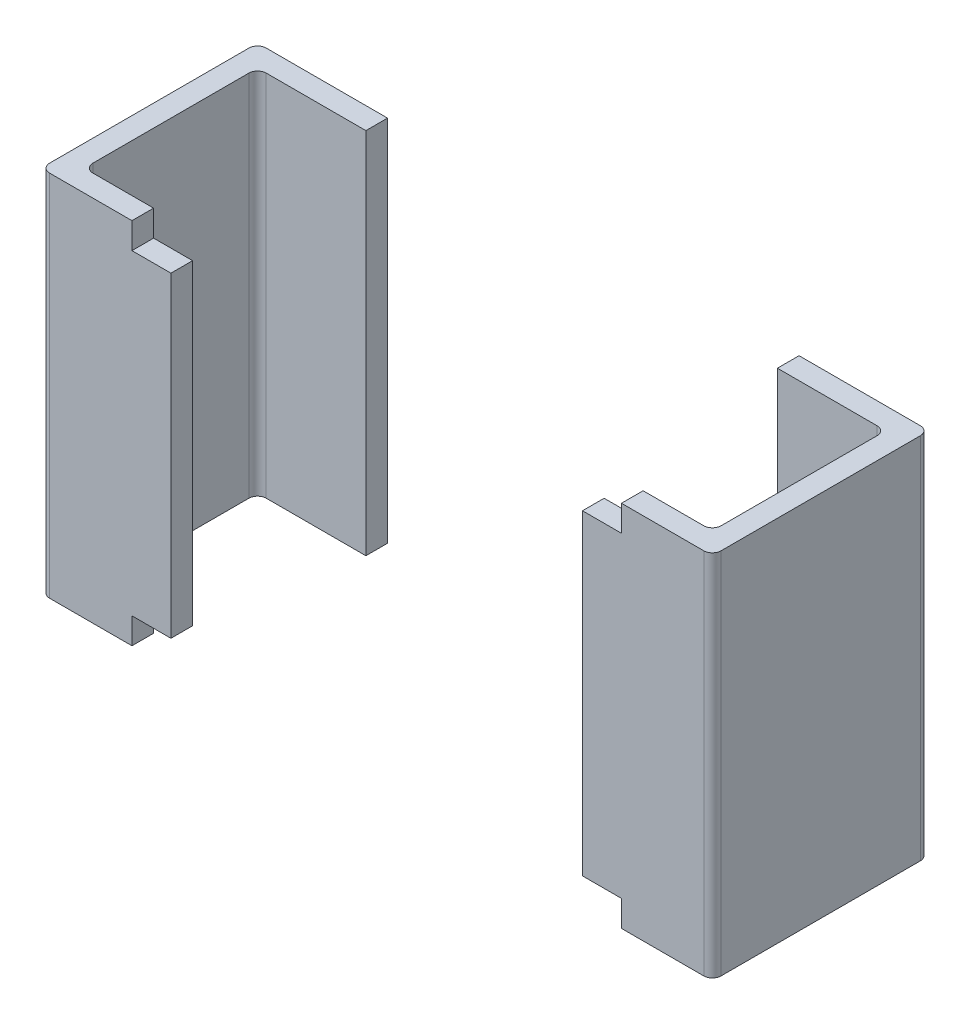
ISO-10303-21;
HEADER;
FILE_DESCRIPTION(('STEP AP214'),'2;1');
FILE_NAME('part.step','',(''),(''),'','','');
FILE_SCHEMA(('AUTOMOTIVE_DESIGN { 1 0 10303 214 1 1 1 1 }'));
ENDSEC;
DATA;
#1=APPLICATION_CONTEXT('core data for automotive mechanical design processes');
#2=APPLICATION_PROTOCOL_DEFINITION('international standard','automotive_design',2000,#1);
#3=PRODUCT_CONTEXT('',#1,'mechanical');
#4=PRODUCT('Part','Part','',(#3));
#5=PRODUCT_RELATED_PRODUCT_CATEGORY('part','',(#4));
#6=PRODUCT_DEFINITION_FORMATION('','',#4);
#7=PRODUCT_DEFINITION_CONTEXT('part definition',#1,'design');
#8=PRODUCT_DEFINITION('design','',#6,#7);
#9=PRODUCT_DEFINITION_SHAPE('','',#8);
#10=(LENGTH_UNIT() NAMED_UNIT(*) SI_UNIT(.MILLI.,.METRE.));
#11=(NAMED_UNIT(*) PLANE_ANGLE_UNIT() SI_UNIT($,.RADIAN.));
#12=(NAMED_UNIT(*) SI_UNIT($,.STERADIAN.) SOLID_ANGLE_UNIT());
#13=UNCERTAINTY_MEASURE_WITH_UNIT(LENGTH_MEASURE(1.E-05),#10,'distance_accuracy_value','');
#14=(GEOMETRIC_REPRESENTATION_CONTEXT(3) GLOBAL_UNCERTAINTY_ASSIGNED_CONTEXT((#13)) GLOBAL_UNIT_ASSIGNED_CONTEXT((#10,
#11,#12)) REPRESENTATION_CONTEXT('',''));
#15=CARTESIAN_POINT('',(0.,0.,0.));
#16=DIRECTION('',(0.,0.,1.));
#17=DIRECTION('',(1.,0.,0.));
#18=AXIS2_PLACEMENT_3D('',#15,#16,#17);
#19=CARTESIAN_POINT('',(-0.705,0.425,0.43));
#20=DIRECTION('',(0.,1.,0.));
#21=DIRECTION('',(-0.707106781186548,0.,0.707106781186548));
#22=AXIS2_PLACEMENT_3D('',#19,#20,#21);
#23=CYLINDRICAL_SURFACE('',#22,0.02);
#24=CARTESIAN_POINT('',(-0.705,-0.425,0.43));
#25=DIRECTION('',(0.,-1.,0.));
#26=DIRECTION('',(-0.707106781186548,0.,0.707106781186548));
#27=AXIS2_PLACEMENT_3D('',#24,#25,#26);
#28=CIRCLE('',#27,0.02);
#29=CARTESIAN_POINT('',(-0.705,-0.425,0.45));
#30=VERTEX_POINT('',#29);
#31=CARTESIAN_POINT('',(-0.725,-0.425,0.43));
#32=VERTEX_POINT('',#31);
#33=EDGE_CURVE('P0_E11',#30,#32,#28,.T.);
#34=ORIENTED_EDGE('',*,*,#33,.T.);
#35=DIRECTION('',(0.,1.,0.));
#36=VECTOR('',#35,1.);
#37=CARTESIAN_POINT('',(-0.725,0.425,0.43));
#38=LINE('',#37,#36);
#39=CARTESIAN_POINT('',(-0.725,0.425,0.43));
#40=VERTEX_POINT('',#39);
#41=EDGE_CURVE('P0_E28',#32,#40,#38,.T.);
#42=ORIENTED_EDGE('',*,*,#41,.T.);
#43=CARTESIAN_POINT('',(-0.705,0.425,0.43));
#44=DIRECTION('',(0.,1.,0.));
#45=DIRECTION('',(-0.707106781186548,0.,0.707106781186548));
#46=AXIS2_PLACEMENT_3D('',#43,#44,#45);
#47=CIRCLE('',#46,0.02);
#48=CARTESIAN_POINT('',(-0.705,0.425,0.45));
#49=VERTEX_POINT('',#48);
#50=EDGE_CURVE('P0_E258',#40,#49,#47,.T.);
#51=ORIENTED_EDGE('',*,*,#50,.T.);
#52=DIRECTION('',(0.,-1.,0.));
#53=VECTOR('',#52,1.);
#54=CARTESIAN_POINT('',(-0.705,0.425,0.45));
#55=LINE('',#54,#53);
#56=EDGE_CURVE('P0_E265',#49,#30,#55,.T.);
#57=ORIENTED_EDGE('',*,*,#56,.T.);
#58=EDGE_LOOP('',(#34,#42,#51,#57));
#59=FACE_BOUND('',#58,.T.);
#60=ADVANCED_FACE('P0_F17',(#59),#23,.F.);
#61=CARTESIAN_POINT('',(-0.725,0.425,0.05));
#62=DIRECTION('',(-1.,0.,0.));
#63=DIRECTION('',(0.,1.,0.));
#64=AXIS2_PLACEMENT_3D('',#61,#62,#63);
#65=PLANE('',#64);
#66=ORIENTED_EDGE('',*,*,#41,.F.);
#67=DIRECTION('',(0.,0.,1.));
#68=VECTOR('',#67,1.);
#69=CARTESIAN_POINT('',(-0.725,-0.425,0.025));
#70=LINE('',#69,#68);
#71=CARTESIAN_POINT('',(-0.725,-0.425,0.07));
#72=VERTEX_POINT('',#71);
#73=EDGE_CURVE('P0_E234',#72,#32,#70,.T.);
#74=ORIENTED_EDGE('',*,*,#73,.F.);
#75=DIRECTION('',(0.,-1.,0.));
#76=VECTOR('',#75,1.);
#77=CARTESIAN_POINT('',(-0.725,0.425,0.07));
#78=LINE('',#77,#76);
#79=CARTESIAN_POINT('',(-0.725,0.425,0.07));
#80=VERTEX_POINT('',#79);
#81=EDGE_CURVE('P0_E245',#80,#72,#78,.T.);
#82=ORIENTED_EDGE('',*,*,#81,.F.);
#83=DIRECTION('',(0.,0.,-1.));
#84=VECTOR('',#83,1.);
#85=CARTESIAN_POINT('',(-0.725,0.425,0.025));
#86=LINE('',#85,#84);
#87=EDGE_CURVE('P0_E202',#40,#80,#86,.T.);
#88=ORIENTED_EDGE('',*,*,#87,.F.);
#89=EDGE_LOOP('',(#66,#74,#82,#88));
#90=FACE_BOUND('',#89,.T.);
#91=ADVANCED_FACE('P0_F355',(#90),#65,.F.);
#92=CARTESIAN_POINT('',(-0.755,0.2125,0.48));
#93=DIRECTION('',(0.,-1.,0.));
#94=DIRECTION('',(-0.707106781186548,0.,0.707106781186548));
#95=AXIS2_PLACEMENT_3D('',#92,#93,#94);
#96=CYLINDRICAL_SURFACE('',#95,0.02);
#97=CARTESIAN_POINT('',(-0.755,-0.425,0.48));
#98=DIRECTION('',(0.,1.,0.));
#99=DIRECTION('',(-0.707106781186548,0.,0.707106781186548));
#100=AXIS2_PLACEMENT_3D('',#97,#98,#99);
#101=CIRCLE('',#100,0.02);
#102=CARTESIAN_POINT('',(-0.775,-0.425,0.48));
#103=VERTEX_POINT('',#102);
#104=CARTESIAN_POINT('',(-0.755,-0.425,0.5));
#105=VERTEX_POINT('',#104);
#106=EDGE_CURVE('P0_E221',#103,#105,#101,.T.);
#107=ORIENTED_EDGE('',*,*,#106,.T.);
#108=DIRECTION('',(0.,1.,0.));
#109=VECTOR('',#108,1.);
#110=CARTESIAN_POINT('',(-0.755,0.2125,0.5));
#111=LINE('',#110,#109);
#112=CARTESIAN_POINT('',(-0.755,0.425,0.5));
#113=VERTEX_POINT('',#112);
#114=EDGE_CURVE('P0_E217',#105,#113,#111,.T.);
#115=ORIENTED_EDGE('',*,*,#114,.T.);
#116=CARTESIAN_POINT('',(-0.755,0.425,0.48));
#117=DIRECTION('',(0.,-1.,0.));
#118=DIRECTION('',(-0.707106781186548,0.,0.707106781186548));
#119=AXIS2_PLACEMENT_3D('',#116,#117,#118);
#120=CIRCLE('',#119,0.02);
#121=CARTESIAN_POINT('',(-0.775,0.425,0.48));
#122=VERTEX_POINT('',#121);
#123=EDGE_CURVE('P0_E222',#113,#122,#120,.T.);
#124=ORIENTED_EDGE('',*,*,#123,.T.);
#125=DIRECTION('',(0.,-1.,0.));
#126=VECTOR('',#125,1.);
#127=CARTESIAN_POINT('',(-0.775,0.2125,0.48));
#128=LINE('',#127,#126);
#129=EDGE_CURVE('P0_E287',#122,#103,#128,.T.);
#130=ORIENTED_EDGE('',*,*,#129,.T.);
#131=EDGE_LOOP('',(#107,#115,#124,#130));
#132=FACE_BOUND('',#131,.T.);
#133=ADVANCED_FACE('P0_F381',(#132),#96,.T.);
#134=CARTESIAN_POINT('',(0.,0.,0.5));
#135=DIRECTION('',(0.,0.,1.));
#136=DIRECTION('',(1.,0.,0.));
#137=AXIS2_PLACEMENT_3D('',#134,#135,#136);
#138=PLANE('',#137);
#139=ORIENTED_EDGE('',*,*,#114,.F.);
#140=DIRECTION('',(1.,0.,0.));
#141=VECTOR('',#140,1.);
#142=CARTESIAN_POINT('',(-0.775,-0.425,0.5));
#143=LINE('',#142,#141);
#144=CARTESIAN_POINT('',(-0.565,-0.425,0.5));
#145=VERTEX_POINT('',#144);
#146=EDGE_CURVE('P0_E283',#105,#145,#143,.T.);
#147=ORIENTED_EDGE('',*,*,#146,.T.);
#148=DIRECTION('',(0.,1.,0.));
#149=VECTOR('',#148,1.);
#150=CARTESIAN_POINT('',(-0.565,-0.2125,0.5));
#151=LINE('',#150,#149);
#152=CARTESIAN_POINT('',(-0.565,-0.365,0.5));
#153=VERTEX_POINT('',#152);
#154=EDGE_CURVE('P0_E288',#145,#153,#151,.T.);
#155=ORIENTED_EDGE('',*,*,#154,.T.);
#156=DIRECTION('',(1.,0.,0.));
#157=VECTOR('',#156,1.);
#158=CARTESIAN_POINT('',(-0.2825,-0.365,0.5));
#159=LINE('',#158,#157);
#160=CARTESIAN_POINT('',(-0.475,-0.365,0.5));
#161=VERTEX_POINT('',#160);
#162=EDGE_CURVE('P0_E179',#153,#161,#159,.T.);
#163=ORIENTED_EDGE('',*,*,#162,.T.);
#164=DIRECTION('',(0.,1.,0.));
#165=VECTOR('',#164,1.);
#166=CARTESIAN_POINT('',(-0.475,0.2125,0.5));
#167=LINE('',#166,#165);
#168=CARTESIAN_POINT('',(-0.475,0.365,0.5));
#169=VERTEX_POINT('',#168);
#170=EDGE_CURVE('P0_E273',#161,#169,#167,.T.);
#171=ORIENTED_EDGE('',*,*,#170,.T.);
#172=DIRECTION('',(-1.,0.,0.));
#173=VECTOR('',#172,1.);
#174=CARTESIAN_POINT('',(-0.2375,0.365,0.5));
#175=LINE('',#174,#173);
#176=CARTESIAN_POINT('',(-0.565,0.365,0.5));
#177=VERTEX_POINT('',#176);
#178=EDGE_CURVE('P0_E269',#169,#177,#175,.T.);
#179=ORIENTED_EDGE('',*,*,#178,.T.);
#180=DIRECTION('',(0.,1.,0.));
#181=VECTOR('',#180,1.);
#182=CARTESIAN_POINT('',(-0.565,0.1825,0.5));
#183=LINE('',#182,#181);
#184=CARTESIAN_POINT('',(-0.565,0.425,0.5));
#185=VERTEX_POINT('',#184);
#186=EDGE_CURVE('P0_E274',#177,#185,#183,.T.);
#187=ORIENTED_EDGE('',*,*,#186,.T.);
#188=DIRECTION('',(-1.,0.,0.));
#189=VECTOR('',#188,1.);
#190=CARTESIAN_POINT('',(0.775,0.425,0.5));
#191=LINE('',#190,#189);
#192=EDGE_CURVE('P0_E306',#185,#113,#191,.T.);
#193=ORIENTED_EDGE('',*,*,#192,.T.);
#194=EDGE_LOOP('',(#139,#147,#155,#163,#171,#179,#187,#193));
#195=FACE_BOUND('',#194,.T.);
#196=ADVANCED_FACE('P0_F384',(#195),#138,.T.);
#197=CARTESIAN_POINT('',(-0.775,-0.425,0.));
#198=DIRECTION('',(0.,-1.,0.));
#199=DIRECTION('',(0.,0.,-1.));
#200=AXIS2_PLACEMENT_3D('',#197,#198,#199);
#201=PLANE('',#200);
#202=ORIENTED_EDGE('',*,*,#106,.F.);
#203=DIRECTION('',(0.,0.,1.));
#204=VECTOR('',#203,1.);
#205=CARTESIAN_POINT('',(-0.775,-0.425,0.));
#206=LINE('',#205,#204);
#207=CARTESIAN_POINT('',(-0.775,-0.425,0.02));
#208=VERTEX_POINT('',#207);
#209=EDGE_CURVE('P0_E226',#208,#103,#206,.T.);
#210=ORIENTED_EDGE('',*,*,#209,.F.);
#211=CARTESIAN_POINT('',(-0.755,-0.425,0.02));
#212=DIRECTION('',(0.,1.,0.));
#213=DIRECTION('',(-0.707106781186548,0.,-0.707106781186548));
#214=AXIS2_PLACEMENT_3D('',#211,#212,#213);
#215=CIRCLE('',#214,0.02);
#216=CARTESIAN_POINT('',(-0.755,-0.425,0.));
#217=VERTEX_POINT('',#216);
#218=EDGE_CURVE('P0_E206',#217,#208,#215,.T.);
#219=ORIENTED_EDGE('',*,*,#218,.F.);
#220=DIRECTION('',(1.,0.,0.));
#221=VECTOR('',#220,1.);
#222=CARTESIAN_POINT('',(-0.775,-0.425,0.));
#223=LINE('',#222,#221);
#224=CARTESIAN_POINT('',(-0.475,-0.425,0.));
#225=VERTEX_POINT('',#224);
#226=EDGE_CURVE('P0_E307',#217,#225,#223,.T.);
#227=ORIENTED_EDGE('',*,*,#226,.T.);
#228=DIRECTION('',(0.,0.,1.));
#229=VECTOR('',#228,1.);
#230=CARTESIAN_POINT('',(-0.475,-0.425,-0.01854871206285));
#231=LINE('',#230,#229);
#232=CARTESIAN_POINT('',(-0.475,-0.425,0.05));
#233=VERTEX_POINT('',#232);
#234=EDGE_CURVE('P0_E250',#225,#233,#231,.T.);
#235=ORIENTED_EDGE('',*,*,#234,.T.);
#236=DIRECTION('',(-1.,0.,0.));
#237=VECTOR('',#236,1.);
#238=CARTESIAN_POINT('',(-0.025,-0.425,0.05));
#239=LINE('',#238,#237);
#240=CARTESIAN_POINT('',(-0.705,-0.425,0.05));
#241=VERTEX_POINT('',#240);
#242=EDGE_CURVE('P0_E246',#233,#241,#239,.T.);
#243=ORIENTED_EDGE('',*,*,#242,.T.);
#244=CARTESIAN_POINT('',(-0.705,-0.425,0.07));
#245=DIRECTION('',(0.,-1.,0.));
#246=DIRECTION('',(-0.707106781186548,0.,-0.707106781186548));
#247=AXIS2_PLACEMENT_3D('',#244,#245,#246);
#248=CIRCLE('',#247,0.02);
#249=EDGE_CURVE('P0_E215',#72,#241,#248,.T.);
#250=ORIENTED_EDGE('',*,*,#249,.F.);
#251=ORIENTED_EDGE('',*,*,#73,.T.);
#252=ORIENTED_EDGE('',*,*,#33,.F.);
#253=DIRECTION('',(1.,0.,0.));
#254=VECTOR('',#253,1.);
#255=CARTESIAN_POINT('',(-0.75,-0.425,0.45));
#256=LINE('',#255,#254);
#257=CARTESIAN_POINT('',(-0.565,-0.425,0.45));
#258=VERTEX_POINT('',#257);
#259=EDGE_CURVE('P0_E231',#30,#258,#256,.T.);
#260=ORIENTED_EDGE('',*,*,#259,.T.);
#261=DIRECTION('',(0.,0.,1.));
#262=VECTOR('',#261,1.);
#263=CARTESIAN_POINT('',(-0.565,-0.425,0.25));
#264=LINE('',#263,#262);
#265=EDGE_CURVE('P0_E187',#258,#145,#264,.T.);
#266=ORIENTED_EDGE('',*,*,#265,.T.);
#267=ORIENTED_EDGE('',*,*,#146,.F.);
#268=EDGE_LOOP('',(#202,#210,#219,#227,#235,#243,#250,#251,#252,#260,#266,#267));
#269=FACE_BOUND('',#268,.T.);
#270=ADVANCED_FACE('P0_F360',(#269),#201,.T.);
#271=CARTESIAN_POINT('',(-0.755,0.2125,0.02));
#272=DIRECTION('',(0.,-1.,0.));
#273=DIRECTION('',(-0.707106781186548,0.,-0.707106781186548));
#274=AXIS2_PLACEMENT_3D('',#271,#272,#273);
#275=CYLINDRICAL_SURFACE('',#274,0.02);
#276=ORIENTED_EDGE('',*,*,#218,.T.);
#277=DIRECTION('',(0.,1.,0.));
#278=VECTOR('',#277,1.);
#279=CARTESIAN_POINT('',(-0.775,0.2125,0.02));
#280=LINE('',#279,#278);
#281=CARTESIAN_POINT('',(-0.775,0.425,0.02));
#282=VERTEX_POINT('',#281);
#283=EDGE_CURVE('P0_E210',#208,#282,#280,.T.);
#284=ORIENTED_EDGE('',*,*,#283,.T.);
#285=CARTESIAN_POINT('',(-0.755,0.425,0.02));
#286=DIRECTION('',(0.,-1.,0.));
#287=DIRECTION('',(-0.707106781186548,0.,-0.707106781186548));
#288=AXIS2_PLACEMENT_3D('',#285,#286,#287);
#289=CIRCLE('',#288,0.02);
#290=CARTESIAN_POINT('',(-0.755,0.425,0.));
#291=VERTEX_POINT('',#290);
#292=EDGE_CURVE('P0_E230',#282,#291,#289,.T.);
#293=ORIENTED_EDGE('',*,*,#292,.T.);
#294=DIRECTION('',(0.,-1.,0.));
#295=VECTOR('',#294,1.);
#296=CARTESIAN_POINT('',(-0.755,0.2125,0.));
#297=LINE('',#296,#295);
#298=EDGE_CURVE('P0_E235',#291,#217,#297,.T.);
#299=ORIENTED_EDGE('',*,*,#298,.T.);
#300=EDGE_LOOP('',(#276,#284,#293,#299));
#301=FACE_BOUND('',#300,.T.);
#302=ADVANCED_FACE('P0_F375',(#301),#275,.T.);
#303=CARTESIAN_POINT('',(0.,0.,0.));
#304=DIRECTION('',(0.,0.,1.));
#305=DIRECTION('',(1.,0.,0.));
#306=AXIS2_PLACEMENT_3D('',#303,#304,#305);
#307=PLANE('',#306);
#308=ORIENTED_EDGE('',*,*,#298,.F.);
#309=DIRECTION('',(-1.,0.,0.));
#310=VECTOR('',#309,1.);
#311=CARTESIAN_POINT('',(0.775,0.425,0.));
#312=LINE('',#311,#310);
#313=CARTESIAN_POINT('',(-0.475,0.425,0.));
#314=VERTEX_POINT('',#313);
#315=EDGE_CURVE('P0_E255',#314,#291,#312,.T.);
#316=ORIENTED_EDGE('',*,*,#315,.F.);
#317=DIRECTION('',(0.,-1.,0.));
#318=VECTOR('',#317,1.);
#319=CARTESIAN_POINT('',(-0.475,0.2125,0.));
#320=LINE('',#319,#318);
#321=EDGE_CURVE('P0_E239',#314,#225,#320,.T.);
#322=ORIENTED_EDGE('',*,*,#321,.T.);
#323=ORIENTED_EDGE('',*,*,#226,.F.);
#324=EDGE_LOOP('',(#308,#316,#322,#323));
#325=FACE_BOUND('',#324,.T.);
#326=ADVANCED_FACE('P0_F372',(#325),#307,.F.);
#327=CARTESIAN_POINT('',(-0.705,0.425,0.07));
#328=DIRECTION('',(0.,1.,0.));
#329=DIRECTION('',(-0.707106781186548,0.,-0.707106781186548));
#330=AXIS2_PLACEMENT_3D('',#327,#328,#329);
#331=CYLINDRICAL_SURFACE('',#330,0.02);
#332=ORIENTED_EDGE('',*,*,#249,.T.);
#333=DIRECTION('',(0.,1.,0.));
#334=VECTOR('',#333,1.);
#335=CARTESIAN_POINT('',(-0.705,0.425,0.05));
#336=LINE('',#335,#334);
#337=CARTESIAN_POINT('',(-0.705,0.425,0.05));
#338=VERTEX_POINT('',#337);
#339=EDGE_CURVE('P0_E211',#241,#338,#336,.T.);
#340=ORIENTED_EDGE('',*,*,#339,.T.);
#341=CARTESIAN_POINT('',(-0.705,0.425,0.07));
#342=DIRECTION('',(0.,1.,0.));
#343=DIRECTION('',(-0.707106781186548,0.,-0.707106781186548));
#344=AXIS2_PLACEMENT_3D('',#341,#342,#343);
#345=CIRCLE('',#344,0.02);
#346=EDGE_CURVE('P0_E216',#338,#80,#345,.T.);
#347=ORIENTED_EDGE('',*,*,#346,.T.);
#348=ORIENTED_EDGE('',*,*,#81,.T.);
#349=EDGE_LOOP('',(#332,#340,#347,#348));
#350=FACE_BOUND('',#349,.T.);
#351=ADVANCED_FACE('P0_F348',(#350),#331,.F.);
#352=CARTESIAN_POINT('',(0.725,0.425,0.05));
#353=DIRECTION('',(0.,0.,-1.));
#354=DIRECTION('',(0.,-1.,0.));
#355=AXIS2_PLACEMENT_3D('',#352,#353,#354);
#356=PLANE('',#355);
#357=ORIENTED_EDGE('',*,*,#339,.F.);
#358=ORIENTED_EDGE('',*,*,#242,.F.);
#359=DIRECTION('',(0.,1.,0.));
#360=VECTOR('',#359,1.);
#361=CARTESIAN_POINT('',(-0.475,0.425,0.05));
#362=LINE('',#361,#360);
#363=CARTESIAN_POINT('',(-0.475,0.425,0.05));
#364=VERTEX_POINT('',#363);
#365=EDGE_CURVE('P0_E183',#233,#364,#362,.T.);
#366=ORIENTED_EDGE('',*,*,#365,.T.);
#367=DIRECTION('',(1.,0.,0.));
#368=VECTOR('',#367,1.);
#369=CARTESIAN_POINT('',(0.75,0.425,0.05));
#370=LINE('',#369,#368);
#371=EDGE_CURVE('P0_E205',#338,#364,#370,.T.);
#372=ORIENTED_EDGE('',*,*,#371,.F.);
#373=EDGE_LOOP('',(#357,#358,#366,#372));
#374=FACE_BOUND('',#373,.T.);
#375=ADVANCED_FACE('P0_F363',(#374),#356,.F.);
#376=CARTESIAN_POINT('',(-0.565,-0.365,0.5));
#377=DIRECTION('',(0.,1.,0.));
#378=DIRECTION('',(1.,0.,0.));
#379=AXIS2_PLACEMENT_3D('',#376,#377,#378);
#380=PLANE('',#379);
#381=DIRECTION('',(-1.,0.,0.));
#382=VECTOR('',#381,1.);
#383=CARTESIAN_POINT('',(-0.645,-0.365,0.45));
#384=LINE('',#383,#382);
#385=CARTESIAN_POINT('',(-0.475,-0.365,0.45));
#386=VERTEX_POINT('',#385);
#387=CARTESIAN_POINT('',(-0.565,-0.365,0.45));
#388=VERTEX_POINT('',#387);
#389=EDGE_CURVE('P0_E161',#386,#388,#384,.T.);
#390=ORIENTED_EDGE('',*,*,#389,.F.);
#391=DIRECTION('',(0.,0.,-1.));
#392=VECTOR('',#391,1.);
#393=CARTESIAN_POINT('',(-0.475,-0.365,0.45));
#394=LINE('',#393,#392);
#395=EDGE_CURVE('P0_E190',#161,#386,#394,.T.);
#396=ORIENTED_EDGE('',*,*,#395,.F.);
#397=ORIENTED_EDGE('',*,*,#162,.F.);
#398=DIRECTION('',(0.,0.,-1.));
#399=VECTOR('',#398,1.);
#400=CARTESIAN_POINT('',(-0.565,-0.365,0.5));
#401=LINE('',#400,#399);
#402=EDGE_CURVE('P0_E176',#153,#388,#401,.T.);
#403=ORIENTED_EDGE('',*,*,#402,.T.);
#404=EDGE_LOOP('',(#390,#396,#397,#403));
#405=FACE_BOUND('',#404,.T.);
#406=ADVANCED_FACE('P0_F177',(#405),#380,.F.);
#407=CARTESIAN_POINT('',(-0.565,-0.425,0.5));
#408=DIRECTION('',(-1.,0.,0.));
#409=DIRECTION('',(0.,0.,1.));
#410=AXIS2_PLACEMENT_3D('',#407,#408,#409);
#411=PLANE('',#410);
#412=DIRECTION('',(0.,-1.,0.));
#413=VECTOR('',#412,1.);
#414=CARTESIAN_POINT('',(-0.565,0.,0.45));
#415=LINE('',#414,#413);
#416=EDGE_CURVE('P0_E167',#388,#258,#415,.T.);
#417=ORIENTED_EDGE('',*,*,#416,.F.);
#418=ORIENTED_EDGE('',*,*,#402,.F.);
#419=ORIENTED_EDGE('',*,*,#154,.F.);
#420=ORIENTED_EDGE('',*,*,#265,.F.);
#421=EDGE_LOOP('',(#417,#418,#419,#420));
#422=FACE_BOUND('',#421,.T.);
#423=ADVANCED_FACE('P0_F185',(#422),#411,.F.);
#424=CARTESIAN_POINT('',(-0.475,0.365,0.5));
#425=DIRECTION('',(0.,-1.,0.));
#426=DIRECTION('',(0.,0.,-1.));
#427=AXIS2_PLACEMENT_3D('',#424,#425,#426);
#428=PLANE('',#427);
#429=DIRECTION('',(1.,0.,0.));
#430=VECTOR('',#429,1.);
#431=CARTESIAN_POINT('',(-0.6,0.365,0.45));
#432=LINE('',#431,#430);
#433=CARTESIAN_POINT('',(-0.565,0.365,0.45));
#434=VERTEX_POINT('',#433);
#435=CARTESIAN_POINT('',(-0.475,0.365,0.45));
#436=VERTEX_POINT('',#435);
#437=EDGE_CURVE('P0_E279',#434,#436,#432,.T.);
#438=ORIENTED_EDGE('',*,*,#437,.F.);
#439=DIRECTION('',(0.,0.,-1.));
#440=VECTOR('',#439,1.);
#441=CARTESIAN_POINT('',(-0.565,0.365,0.5));
#442=LINE('',#441,#440);
#443=EDGE_CURVE('P0_E21',#177,#434,#442,.T.);
#444=ORIENTED_EDGE('',*,*,#443,.F.);
#445=ORIENTED_EDGE('',*,*,#178,.F.);
#446=DIRECTION('',(0.,0.,1.));
#447=VECTOR('',#446,1.);
#448=CARTESIAN_POINT('',(-0.475,0.365,0.45));
#449=LINE('',#448,#447);
#450=EDGE_CURVE('P0_E196',#436,#169,#449,.T.);
#451=ORIENTED_EDGE('',*,*,#450,.F.);
#452=EDGE_LOOP('',(#438,#444,#445,#451));
#453=FACE_BOUND('',#452,.T.);
#454=ADVANCED_FACE('P0_F19',(#453),#428,.F.);
#455=CARTESIAN_POINT('',(-0.565,0.365,0.5));
#456=DIRECTION('',(-1.,0.,0.));
#457=DIRECTION('',(0.,0.,1.));
#458=AXIS2_PLACEMENT_3D('',#455,#456,#457);
#459=PLANE('',#458);
#460=DIRECTION('',(0.,-1.,0.));
#461=VECTOR('',#460,1.);
#462=CARTESIAN_POINT('',(-0.565,0.395,0.45));
#463=LINE('',#462,#461);
#464=CARTESIAN_POINT('',(-0.565,0.425,0.45));
#465=VERTEX_POINT('',#464);
#466=EDGE_CURVE('P0_E275',#465,#434,#463,.T.);
#467=ORIENTED_EDGE('',*,*,#466,.F.);
#468=DIRECTION('',(0.,0.,-1.));
#469=VECTOR('',#468,1.);
#470=CARTESIAN_POINT('',(-0.565,0.425,0.25));
#471=LINE('',#470,#469);
#472=EDGE_CURVE('P0_E333',#185,#465,#471,.T.);
#473=ORIENTED_EDGE('',*,*,#472,.F.);
#474=ORIENTED_EDGE('',*,*,#186,.F.);
#475=ORIENTED_EDGE('',*,*,#443,.T.);
#476=EDGE_LOOP('',(#467,#473,#474,#475));
#477=FACE_BOUND('',#476,.T.);
#478=ADVANCED_FACE('P0_F390',(#477),#459,.F.);
#479=CARTESIAN_POINT('',(-0.725,0.425,0.45));
#480=DIRECTION('',(0.,0.,1.));
#481=DIRECTION('',(1.,0.,0.));
#482=AXIS2_PLACEMENT_3D('',#479,#480,#481);
#483=PLANE('',#482);
#484=ORIENTED_EDGE('',*,*,#56,.F.);
#485=DIRECTION('',(-1.,0.,0.));
#486=VECTOR('',#485,1.);
#487=CARTESIAN_POINT('',(0.025,0.425,0.45));
#488=LINE('',#487,#486);
#489=EDGE_CURVE('P0_E204',#465,#49,#488,.T.);
#490=ORIENTED_EDGE('',*,*,#489,.F.);
#491=ORIENTED_EDGE('',*,*,#466,.T.);
#492=ORIENTED_EDGE('',*,*,#437,.T.);
#493=DIRECTION('',(0.,-1.,0.));
#494=VECTOR('',#493,1.);
#495=CARTESIAN_POINT('',(-0.475,0.425,0.45));
#496=LINE('',#495,#494);
#497=EDGE_CURVE('P0_E170',#436,#386,#496,.T.);
#498=ORIENTED_EDGE('',*,*,#497,.T.);
#499=ORIENTED_EDGE('',*,*,#389,.T.);
#500=ORIENTED_EDGE('',*,*,#416,.T.);
#501=ORIENTED_EDGE('',*,*,#259,.F.);
#502=EDGE_LOOP('',(#484,#490,#491,#492,#498,#499,#500,#501));
#503=FACE_BOUND('',#502,.T.);
#504=ADVANCED_FACE('P0_F164',(#503),#483,.F.);
#505=CARTESIAN_POINT('',(-0.475,0.425,0.4));
#506=DIRECTION('',(-1.,0.,0.));
#507=DIRECTION('',(0.,1.,0.));
#508=AXIS2_PLACEMENT_3D('',#505,#506,#507);
#509=PLANE('',#508);
#510=ORIENTED_EDGE('',*,*,#395,.T.);
#511=ORIENTED_EDGE('',*,*,#497,.F.);
#512=ORIENTED_EDGE('',*,*,#450,.T.);
#513=ORIENTED_EDGE('',*,*,#170,.F.);
#514=EDGE_LOOP('',(#510,#511,#512,#513));
#515=FACE_BOUND('',#514,.T.);
#516=ADVANCED_FACE('P0_F395',(#515),#509,.F.);
#517=CARTESIAN_POINT('',(-0.775,0.425,0.));
#518=DIRECTION('',(-1.,0.,0.));
#519=DIRECTION('',(0.,0.,1.));
#520=AXIS2_PLACEMENT_3D('',#517,#518,#519);
#521=PLANE('',#520);
#522=ORIENTED_EDGE('',*,*,#129,.F.);
#523=DIRECTION('',(0.,0.,1.));
#524=VECTOR('',#523,1.);
#525=CARTESIAN_POINT('',(-0.775,0.425,0.));
#526=LINE('',#525,#524);
#527=EDGE_CURVE('P0_E251',#282,#122,#526,.T.);
#528=ORIENTED_EDGE('',*,*,#527,.F.);
#529=ORIENTED_EDGE('',*,*,#283,.F.);
#530=ORIENTED_EDGE('',*,*,#209,.T.);
#531=EDGE_LOOP('',(#522,#528,#529,#530));
#532=FACE_BOUND('',#531,.T.);
#533=ADVANCED_FACE('P0_F379',(#532),#521,.T.);
#534=CARTESIAN_POINT('',(0.775,0.425,0.));
#535=DIRECTION('',(0.,1.,0.));
#536=DIRECTION('',(1.,0.,0.));
#537=AXIS2_PLACEMENT_3D('',#534,#535,#536);
#538=PLANE('',#537);
#539=ORIENTED_EDGE('',*,*,#123,.F.);
#540=ORIENTED_EDGE('',*,*,#192,.F.);
#541=ORIENTED_EDGE('',*,*,#472,.T.);
#542=ORIENTED_EDGE('',*,*,#489,.T.);
#543=ORIENTED_EDGE('',*,*,#50,.F.);
#544=ORIENTED_EDGE('',*,*,#87,.T.);
#545=ORIENTED_EDGE('',*,*,#346,.F.);
#546=ORIENTED_EDGE('',*,*,#371,.T.);
#547=DIRECTION('',(0.,0.,-1.));
#548=VECTOR('',#547,1.);
#549=CARTESIAN_POINT('',(-0.475,0.425,-0.01854871206285));
#550=LINE('',#549,#548);
#551=EDGE_CURVE('P0_E200',#364,#314,#550,.T.);
#552=ORIENTED_EDGE('',*,*,#551,.T.);
#553=ORIENTED_EDGE('',*,*,#315,.T.);
#554=ORIENTED_EDGE('',*,*,#292,.F.);
#555=ORIENTED_EDGE('',*,*,#527,.T.);
#556=EDGE_LOOP('',(#539,#540,#541,#542,#543,#544,#545,#546,#552,#553,#554,#555));
#557=FACE_BOUND('',#556,.T.);
#558=ADVANCED_FACE('P0_F353',(#557),#538,.T.);
#559=CARTESIAN_POINT('',(-0.475,0.425,-0.03709742412571));
#560=DIRECTION('',(-1.,0.,0.));
#561=DIRECTION('',(0.,1.,0.));
#562=AXIS2_PLACEMENT_3D('',#559,#560,#561);
#563=PLANE('',#562);
#564=ORIENTED_EDGE('',*,*,#234,.F.);
#565=ORIENTED_EDGE('',*,*,#321,.F.);
#566=ORIENTED_EDGE('',*,*,#551,.F.);
#567=ORIENTED_EDGE('',*,*,#365,.F.);
#568=EDGE_LOOP('',(#564,#565,#566,#567));
#569=FACE_BOUND('',#568,.T.);
#570=ADVANCED_FACE('P0_F367',(#569),#563,.F.);
#571=CLOSED_SHELL('',(#60,#91,#133,#196,#270,#302,#326,#351,#375,#406,#423,#454,#478,#504,#516,
#533,#558,#570));
#572=MANIFOLD_SOLID_BREP('P0_B1',#571);
#573=CARTESIAN_POINT('',(0.705,0.425,0.07));
#574=DIRECTION('',(0.,-1.,0.));
#575=DIRECTION('',(0.707106781186548,0.,-0.707106781186548));
#576=AXIS2_PLACEMENT_3D('',#573,#574,#575);
#577=CYLINDRICAL_SURFACE('',#576,0.02);
#578=CARTESIAN_POINT('',(0.705,0.425,0.07));
#579=DIRECTION('',(0.,1.,0.));
#580=DIRECTION('',(0.707106781186548,0.,-0.707106781186548));
#581=AXIS2_PLACEMENT_3D('',#578,#579,#580);
#582=CIRCLE('',#581,0.02);
#583=CARTESIAN_POINT('',(0.725,0.425,0.07));
#584=VERTEX_POINT('',#583);
#585=CARTESIAN_POINT('',(0.705,0.425,0.05));
#586=VERTEX_POINT('',#585);
#587=EDGE_CURVE('P1_E11',#584,#586,#582,.T.);
#588=ORIENTED_EDGE('',*,*,#587,.T.);
#589=DIRECTION('',(0.,-1.,0.));
#590=VECTOR('',#589,1.);
#591=CARTESIAN_POINT('',(0.705,0.425,0.05));
#592=LINE('',#591,#590);
#593=CARTESIAN_POINT('',(0.705,-0.425,0.05));
#594=VERTEX_POINT('',#593);
#595=EDGE_CURVE('P1_E27',#586,#594,#592,.T.);
#596=ORIENTED_EDGE('',*,*,#595,.T.);
#597=CARTESIAN_POINT('',(0.705,-0.425,0.07));
#598=DIRECTION('',(0.,-1.,0.));
#599=DIRECTION('',(0.707106781186548,0.,-0.707106781186548));
#600=AXIS2_PLACEMENT_3D('',#597,#598,#599);
#601=CIRCLE('',#600,0.02);
#602=CARTESIAN_POINT('',(0.725,-0.425,0.07));
#603=VERTEX_POINT('',#602);
#604=EDGE_CURVE('P1_E299',#594,#603,#601,.T.);
#605=ORIENTED_EDGE('',*,*,#604,.T.);
#606=DIRECTION('',(0.,1.,0.));
#607=VECTOR('',#606,1.);
#608=CARTESIAN_POINT('',(0.725,0.425,0.07));
#609=LINE('',#608,#607);
#610=EDGE_CURVE('P1_E220',#603,#584,#609,.T.);
#611=ORIENTED_EDGE('',*,*,#610,.T.);
#612=EDGE_LOOP('',(#588,#596,#605,#611));
#613=FACE_BOUND('',#612,.T.);
#614=ADVANCED_FACE('P1_F17',(#613),#577,.F.);
#615=CARTESIAN_POINT('',(0.725,0.425,0.05));
#616=DIRECTION('',(0.,0.,-1.));
#617=DIRECTION('',(0.,-1.,0.));
#618=AXIS2_PLACEMENT_3D('',#615,#616,#617);
#619=PLANE('',#618);
#620=ORIENTED_EDGE('',*,*,#595,.F.);
#621=DIRECTION('',(1.,0.,0.));
#622=VECTOR('',#621,1.);
#623=CARTESIAN_POINT('',(0.75,0.425,0.05));
#624=LINE('',#623,#622);
#625=CARTESIAN_POINT('',(0.475,0.425,0.05));
#626=VERTEX_POINT('',#625);
#627=EDGE_CURVE('P1_E332',#626,#586,#624,.T.);
#628=ORIENTED_EDGE('',*,*,#627,.F.);
#629=DIRECTION('',(0.,-1.,0.));
#630=VECTOR('',#629,1.);
#631=CARTESIAN_POINT('',(0.475,0.425,0.05));
#632=LINE('',#631,#630);
#633=CARTESIAN_POINT('',(0.475,-0.425,0.05));
#634=VERTEX_POINT('',#633);
#635=EDGE_CURVE('P1_E303',#626,#634,#632,.T.);
#636=ORIENTED_EDGE('',*,*,#635,.T.);
#637=DIRECTION('',(-1.,0.,0.));
#638=VECTOR('',#637,1.);
#639=CARTESIAN_POINT('',(-0.025,-0.425,0.05));
#640=LINE('',#639,#638);
#641=EDGE_CURVE('P1_E20',#594,#634,#640,.T.);
#642=ORIENTED_EDGE('',*,*,#641,.F.);
#643=EDGE_LOOP('',(#620,#628,#636,#642));
#644=FACE_BOUND('',#643,.T.);
#645=ADVANCED_FACE('P1_F381',(#644),#619,.F.);
#646=CARTESIAN_POINT('',(0.755,-0.2125,0.02));
#647=DIRECTION('',(0.,1.,0.));
#648=DIRECTION('',(0.707106781186548,0.,-0.707106781186548));
#649=AXIS2_PLACEMENT_3D('',#646,#647,#648);
#650=CYLINDRICAL_SURFACE('',#649,0.02);
#651=CARTESIAN_POINT('',(0.755,0.425,0.02));
#652=DIRECTION('',(0.,-1.,0.));
#653=DIRECTION('',(0.707106781186548,0.,-0.707106781186548));
#654=AXIS2_PLACEMENT_3D('',#651,#652,#653);
#655=CIRCLE('',#654,0.02);
#656=CARTESIAN_POINT('',(0.755,0.425,0.));
#657=VERTEX_POINT('',#656);
#658=CARTESIAN_POINT('',(0.775,0.425,0.02));
#659=VERTEX_POINT('',#658);
#660=EDGE_CURVE('P1_E307',#657,#659,#655,.T.);
#661=ORIENTED_EDGE('',*,*,#660,.T.);
#662=DIRECTION('',(0.,-1.,0.));
#663=VECTOR('',#662,1.);
#664=CARTESIAN_POINT('',(0.775,-0.2125,0.02));
#665=LINE('',#664,#663);
#666=CARTESIAN_POINT('',(0.775,-0.425,0.02));
#667=VERTEX_POINT('',#666);
#668=EDGE_CURVE('P1_E203',#659,#667,#665,.T.);
#669=ORIENTED_EDGE('',*,*,#668,.T.);
#670=CARTESIAN_POINT('',(0.755,-0.425,0.02));
#671=DIRECTION('',(0.,1.,0.));
#672=DIRECTION('',(0.707106781186548,0.,-0.707106781186548));
#673=AXIS2_PLACEMENT_3D('',#670,#671,#672);
#674=CIRCLE('',#673,0.02);
#675=CARTESIAN_POINT('',(0.755,-0.425,0.));
#676=VERTEX_POINT('',#675);
#677=EDGE_CURVE('P1_E194',#667,#676,#674,.T.);
#678=ORIENTED_EDGE('',*,*,#677,.T.);
#679=DIRECTION('',(0.,1.,0.));
#680=VECTOR('',#679,1.);
#681=CARTESIAN_POINT('',(0.755,-0.2125,0.));
#682=LINE('',#681,#680);
#683=EDGE_CURVE('P1_E192',#676,#657,#682,.T.);
#684=ORIENTED_EDGE('',*,*,#683,.T.);
#685=EDGE_LOOP('',(#661,#669,#678,#684));
#686=FACE_BOUND('',#685,.T.);
#687=ADVANCED_FACE('P1_F444',(#686),#650,.T.);
#688=CARTESIAN_POINT('',(0.,0.,0.));
#689=DIRECTION('',(0.,0.,1.));
#690=DIRECTION('',(1.,0.,0.));
#691=AXIS2_PLACEMENT_3D('',#688,#689,#690);
#692=PLANE('',#691);
#693=ORIENTED_EDGE('',*,*,#683,.F.);
#694=DIRECTION('',(1.,0.,0.));
#695=VECTOR('',#694,1.);
#696=CARTESIAN_POINT('',(-0.775,-0.425,0.));
#697=LINE('',#696,#695);
#698=CARTESIAN_POINT('',(0.475,-0.425,0.));
#699=VERTEX_POINT('',#698);
#700=EDGE_CURVE('P1_E226',#699,#676,#697,.T.);
#701=ORIENTED_EDGE('',*,*,#700,.F.);
#702=DIRECTION('',(0.,1.,0.));
#703=VECTOR('',#702,1.);
#704=CARTESIAN_POINT('',(0.475,0.2125,0.));
#705=LINE('',#704,#703);
#706=CARTESIAN_POINT('',(0.475,0.425,0.));
#707=VERTEX_POINT('',#706);
#708=EDGE_CURVE('P1_E195',#699,#707,#705,.T.);
#709=ORIENTED_EDGE('',*,*,#708,.T.);
#710=DIRECTION('',(-1.,0.,0.));
#711=VECTOR('',#710,1.);
#712=CARTESIAN_POINT('',(0.775,0.425,0.));
#713=LINE('',#712,#711);
#714=EDGE_CURVE('P1_E158',#657,#707,#713,.T.);
#715=ORIENTED_EDGE('',*,*,#714,.F.);
#716=EDGE_LOOP('',(#693,#701,#709,#715));
#717=FACE_BOUND('',#716,.T.);
#718=ADVANCED_FACE('P1_F449',(#717),#692,.F.);
#719=CARTESIAN_POINT('',(-0.775,-0.425,0.));
#720=DIRECTION('',(0.,-1.,0.));
#721=DIRECTION('',(0.,0.,-1.));
#722=AXIS2_PLACEMENT_3D('',#719,#720,#721);
#723=PLANE('',#722);
#724=ORIENTED_EDGE('',*,*,#677,.F.);
#725=DIRECTION('',(0.,0.,1.));
#726=VECTOR('',#725,1.);
#727=CARTESIAN_POINT('',(0.775,-0.425,0.));
#728=LINE('',#727,#726);
#729=CARTESIAN_POINT('',(0.775,-0.425,0.48));
#730=VERTEX_POINT('',#729);
#731=EDGE_CURVE('P1_E168',#667,#730,#728,.T.);
#732=ORIENTED_EDGE('',*,*,#731,.T.);
#733=CARTESIAN_POINT('',(0.755,-0.425,0.48));
#734=DIRECTION('',(0.,1.,0.));
#735=DIRECTION('',(0.707106781186548,0.,0.707106781186548));
#736=AXIS2_PLACEMENT_3D('',#733,#734,#735);
#737=CIRCLE('',#736,0.02);
#738=CARTESIAN_POINT('',(0.755,-0.425,0.5));
#739=VERTEX_POINT('',#738);
#740=EDGE_CURVE('P1_E154',#739,#730,#737,.T.);
#741=ORIENTED_EDGE('',*,*,#740,.F.);
#742=DIRECTION('',(1.,0.,0.));
#743=VECTOR('',#742,1.);
#744=CARTESIAN_POINT('',(-0.775,-0.425,0.5));
#745=LINE('',#744,#743);
#746=CARTESIAN_POINT('',(0.565,-0.425,0.5));
#747=VERTEX_POINT('',#746);
#748=EDGE_CURVE('P1_E142',#747,#739,#745,.T.);
#749=ORIENTED_EDGE('',*,*,#748,.F.);
#750=DIRECTION('',(0.,0.,-1.));
#751=VECTOR('',#750,1.);
#752=CARTESIAN_POINT('',(0.565,-0.425,0.25));
#753=LINE('',#752,#751);
#754=CARTESIAN_POINT('',(0.565,-0.425,0.45));
#755=VERTEX_POINT('',#754);
#756=EDGE_CURVE('P1_E151',#747,#755,#753,.T.);
#757=ORIENTED_EDGE('',*,*,#756,.T.);
#758=DIRECTION('',(1.,0.,0.));
#759=VECTOR('',#758,1.);
#760=CARTESIAN_POINT('',(-0.75,-0.425,0.45));
#761=LINE('',#760,#759);
#762=CARTESIAN_POINT('',(0.705,-0.425,0.45));
#763=VERTEX_POINT('',#762);
#764=EDGE_CURVE('P1_E169',#755,#763,#761,.T.);
#765=ORIENTED_EDGE('',*,*,#764,.T.);
#766=CARTESIAN_POINT('',(0.705,-0.425,0.43));
#767=DIRECTION('',(0.,-1.,0.));
#768=DIRECTION('',(0.707106781186548,0.,0.707106781186548));
#769=AXIS2_PLACEMENT_3D('',#766,#767,#768);
#770=CIRCLE('',#769,0.02);
#771=CARTESIAN_POINT('',(0.725,-0.425,0.43));
#772=VERTEX_POINT('',#771);
#773=EDGE_CURVE('P1_E191',#772,#763,#770,.T.);
#774=ORIENTED_EDGE('',*,*,#773,.F.);
#775=DIRECTION('',(0.,0.,-1.));
#776=VECTOR('',#775,1.);
#777=CARTESIAN_POINT('',(0.725,-0.425,0.225));
#778=LINE('',#777,#776);
#779=EDGE_CURVE('P1_E302',#772,#603,#778,.T.);
#780=ORIENTED_EDGE('',*,*,#779,.T.);
#781=ORIENTED_EDGE('',*,*,#604,.F.);
#782=ORIENTED_EDGE('',*,*,#641,.T.);
#783=DIRECTION('',(0.,0.,-1.));
#784=VECTOR('',#783,1.);
#785=CARTESIAN_POINT('',(0.475,-0.425,0.06854871206285));
#786=LINE('',#785,#784);
#787=EDGE_CURVE('P1_E233',#634,#699,#786,.T.);
#788=ORIENTED_EDGE('',*,*,#787,.T.);
#789=ORIENTED_EDGE('',*,*,#700,.T.);
#790=EDGE_LOOP('',(#724,#732,#741,#749,#757,#765,#774,#780,#781,#782,#788,#789));
#791=FACE_BOUND('',#790,.T.);
#792=ADVANCED_FACE('P1_F149',(#791),#723,.T.);
#793=CARTESIAN_POINT('',(0.755,-0.2125,0.48));
#794=DIRECTION('',(0.,1.,0.));
#795=DIRECTION('',(0.707106781186548,0.,0.707106781186548));
#796=AXIS2_PLACEMENT_3D('',#793,#794,#795);
#797=CYLINDRICAL_SURFACE('',#796,0.02);
#798=CARTESIAN_POINT('',(0.755,0.425,0.48));
#799=DIRECTION('',(0.,-1.,0.));
#800=DIRECTION('',(0.707106781186548,0.,0.707106781186548));
#801=AXIS2_PLACEMENT_3D('',#798,#799,#800);
#802=CIRCLE('',#801,0.02);
#803=CARTESIAN_POINT('',(0.775,0.425,0.48));
#804=VERTEX_POINT('',#803);
#805=CARTESIAN_POINT('',(0.755,0.425,0.5));
#806=VERTEX_POINT('',#805);
#807=EDGE_CURVE('P1_E223',#804,#806,#802,.T.);
#808=ORIENTED_EDGE('',*,*,#807,.T.);
#809=DIRECTION('',(0.,-1.,0.));
#810=VECTOR('',#809,1.);
#811=CARTESIAN_POINT('',(0.755,-0.2125,0.5));
#812=LINE('',#811,#810);
#813=EDGE_CURVE('P1_E186',#806,#739,#812,.T.);
#814=ORIENTED_EDGE('',*,*,#813,.T.);
#815=ORIENTED_EDGE('',*,*,#740,.T.);
#816=DIRECTION('',(0.,1.,0.));
#817=VECTOR('',#816,1.);
#818=CARTESIAN_POINT('',(0.775,-0.2125,0.48));
#819=LINE('',#818,#817);
#820=EDGE_CURVE('P1_E222',#730,#804,#819,.T.);
#821=ORIENTED_EDGE('',*,*,#820,.T.);
#822=EDGE_LOOP('',(#808,#814,#815,#821));
#823=FACE_BOUND('',#822,.T.);
#824=ADVANCED_FACE('P1_F236',(#823),#797,.T.);
#825=CARTESIAN_POINT('',(0.,0.,0.5));
#826=DIRECTION('',(0.,0.,1.));
#827=DIRECTION('',(1.,0.,0.));
#828=AXIS2_PLACEMENT_3D('',#825,#826,#827);
#829=PLANE('',#828);
#830=ORIENTED_EDGE('',*,*,#813,.F.);
#831=DIRECTION('',(-1.,0.,0.));
#832=VECTOR('',#831,1.);
#833=CARTESIAN_POINT('',(0.775,0.425,0.5));
#834=LINE('',#833,#832);
#835=CARTESIAN_POINT('',(0.565,0.425,0.5));
#836=VERTEX_POINT('',#835);
#837=EDGE_CURVE('P1_E239',#806,#836,#834,.T.);
#838=ORIENTED_EDGE('',*,*,#837,.T.);
#839=DIRECTION('',(0.,-1.,0.));
#840=VECTOR('',#839,1.);
#841=CARTESIAN_POINT('',(0.565,0.2125,0.5));
#842=LINE('',#841,#840);
#843=CARTESIAN_POINT('',(0.565,0.365,0.5));
#844=VERTEX_POINT('',#843);
#845=EDGE_CURVE('P1_E241',#836,#844,#842,.T.);
#846=ORIENTED_EDGE('',*,*,#845,.T.);
#847=DIRECTION('',(-1.,0.,0.));
#848=VECTOR('',#847,1.);
#849=CARTESIAN_POINT('',(0.2825,0.365,0.5));
#850=LINE('',#849,#848);
#851=CARTESIAN_POINT('',(0.475,0.365,0.5));
#852=VERTEX_POINT('',#851);
#853=EDGE_CURVE('P1_E257',#844,#852,#850,.T.);
#854=ORIENTED_EDGE('',*,*,#853,.T.);
#855=DIRECTION('',(0.,-1.,0.));
#856=VECTOR('',#855,1.);
#857=CARTESIAN_POINT('',(0.475,0.2125,0.5));
#858=LINE('',#857,#856);
#859=CARTESIAN_POINT('',(0.475,-0.365,0.5));
#860=VERTEX_POINT('',#859);
#861=EDGE_CURVE('P1_E182',#852,#860,#858,.T.);
#862=ORIENTED_EDGE('',*,*,#861,.T.);
#863=DIRECTION('',(1.,0.,0.));
#864=VECTOR('',#863,1.);
#865=CARTESIAN_POINT('',(0.2375,-0.365,0.5));
#866=LINE('',#865,#864);
#867=CARTESIAN_POINT('',(0.565,-0.365,0.5));
#868=VERTEX_POINT('',#867);
#869=EDGE_CURVE('P1_E174',#860,#868,#866,.T.);
#870=ORIENTED_EDGE('',*,*,#869,.T.);
#871=DIRECTION('',(0.,-1.,0.));
#872=VECTOR('',#871,1.);
#873=CARTESIAN_POINT('',(0.565,-0.1825,0.5));
#874=LINE('',#873,#872);
#875=EDGE_CURVE('P1_E157',#868,#747,#874,.T.);
#876=ORIENTED_EDGE('',*,*,#875,.T.);
#877=ORIENTED_EDGE('',*,*,#748,.T.);
#878=EDGE_LOOP('',(#830,#838,#846,#854,#862,#870,#876,#877));
#879=FACE_BOUND('',#878,.T.);
#880=ADVANCED_FACE('P1_F171',(#879),#829,.T.);
#881=CARTESIAN_POINT('',(0.775,0.425,0.));
#882=DIRECTION('',(0.,1.,0.));
#883=DIRECTION('',(1.,0.,0.));
#884=AXIS2_PLACEMENT_3D('',#881,#882,#883);
#885=PLANE('',#884);
#886=ORIENTED_EDGE('',*,*,#660,.F.);
#887=ORIENTED_EDGE('',*,*,#714,.T.);
#888=DIRECTION('',(0.,0.,1.));
#889=VECTOR('',#888,1.);
#890=CARTESIAN_POINT('',(0.475,0.425,0.06854871206285));
#891=LINE('',#890,#889);
#892=EDGE_CURVE('P1_E321',#707,#626,#891,.T.);
#893=ORIENTED_EDGE('',*,*,#892,.T.);
#894=ORIENTED_EDGE('',*,*,#627,.T.);
#895=ORIENTED_EDGE('',*,*,#587,.F.);
#896=DIRECTION('',(0.,0.,1.));
#897=VECTOR('',#896,1.);
#898=CARTESIAN_POINT('',(0.725,0.425,0.225));
#899=LINE('',#898,#897);
#900=CARTESIAN_POINT('',(0.725,0.425,0.43));
#901=VERTEX_POINT('',#900);
#902=EDGE_CURVE('P1_E328',#584,#901,#899,.T.);
#903=ORIENTED_EDGE('',*,*,#902,.T.);
#904=CARTESIAN_POINT('',(0.705,0.425,0.43));
#905=DIRECTION('',(0.,1.,0.));
#906=DIRECTION('',(0.707106781186548,0.,0.707106781186548));
#907=AXIS2_PLACEMENT_3D('',#904,#905,#906);
#908=CIRCLE('',#907,0.02);
#909=CARTESIAN_POINT('',(0.705,0.425,0.45));
#910=VERTEX_POINT('',#909);
#911=EDGE_CURVE('P1_E327',#910,#901,#908,.T.);
#912=ORIENTED_EDGE('',*,*,#911,.F.);
#913=DIRECTION('',(-1.,0.,0.));
#914=VECTOR('',#913,1.);
#915=CARTESIAN_POINT('',(0.025,0.425,0.45));
#916=LINE('',#915,#914);
#917=CARTESIAN_POINT('',(0.565,0.425,0.45));
#918=VERTEX_POINT('',#917);
#919=EDGE_CURVE('P1_E190',#910,#918,#916,.T.);
#920=ORIENTED_EDGE('',*,*,#919,.T.);
#921=DIRECTION('',(0.,0.,1.));
#922=VECTOR('',#921,1.);
#923=CARTESIAN_POINT('',(0.565,0.425,0.25));
#924=LINE('',#923,#922);
#925=EDGE_CURVE('P1_E188',#918,#836,#924,.T.);
#926=ORIENTED_EDGE('',*,*,#925,.T.);
#927=ORIENTED_EDGE('',*,*,#837,.F.);
#928=ORIENTED_EDGE('',*,*,#807,.F.);
#929=DIRECTION('',(0.,0.,1.));
#930=VECTOR('',#929,1.);
#931=CARTESIAN_POINT('',(0.775,0.425,0.));
#932=LINE('',#931,#930);
#933=EDGE_CURVE('P1_E291',#659,#804,#932,.T.);
#934=ORIENTED_EDGE('',*,*,#933,.F.);
#935=EDGE_LOOP('',(#886,#887,#893,#894,#895,#903,#912,#920,#926,#927,#928,#934));
#936=FACE_BOUND('',#935,.T.);
#937=ADVANCED_FACE('P1_F247',(#936),#885,.T.);
#938=CARTESIAN_POINT('',(0.705,0.425,0.43));
#939=DIRECTION('',(0.,1.,0.));
#940=DIRECTION('',(0.707106781186548,0.,0.707106781186548));
#941=AXIS2_PLACEMENT_3D('',#938,#939,#940);
#942=CYLINDRICAL_SURFACE('',#941,0.02);
#943=ORIENTED_EDGE('',*,*,#773,.T.);
#944=DIRECTION('',(0.,1.,0.));
#945=VECTOR('',#944,1.);
#946=CARTESIAN_POINT('',(0.705,0.425,0.45));
#947=LINE('',#946,#945);
#948=EDGE_CURVE('P1_E323',#763,#910,#947,.T.);
#949=ORIENTED_EDGE('',*,*,#948,.T.);
#950=ORIENTED_EDGE('',*,*,#911,.T.);
#951=DIRECTION('',(0.,-1.,0.));
#952=VECTOR('',#951,1.);
#953=CARTESIAN_POINT('',(0.725,0.425,0.43));
#954=LINE('',#953,#952);
#955=EDGE_CURVE('P1_E319',#901,#772,#954,.T.);
#956=ORIENTED_EDGE('',*,*,#955,.T.);
#957=EDGE_LOOP('',(#943,#949,#950,#956));
#958=FACE_BOUND('',#957,.T.);
#959=ADVANCED_FACE('P1_F343',(#958),#942,.F.);
#960=CARTESIAN_POINT('',(-0.725,0.425,0.45));
#961=DIRECTION('',(0.,0.,1.));
#962=DIRECTION('',(1.,0.,0.));
#963=AXIS2_PLACEMENT_3D('',#960,#961,#962);
#964=PLANE('',#963);
#965=ORIENTED_EDGE('',*,*,#948,.F.);
#966=ORIENTED_EDGE('',*,*,#764,.F.);
#967=DIRECTION('',(0.,1.,0.));
#968=VECTOR('',#967,1.);
#969=CARTESIAN_POINT('',(0.565,0.03,0.45));
#970=LINE('',#969,#968);
#971=CARTESIAN_POINT('',(0.565,-0.365,0.45));
#972=VERTEX_POINT('',#971);
#973=EDGE_CURVE('P1_E166',#755,#972,#970,.T.);
#974=ORIENTED_EDGE('',*,*,#973,.T.);
#975=DIRECTION('',(-1.,0.,0.));
#976=VECTOR('',#975,1.);
#977=CARTESIAN_POINT('',(-0.125,-0.365,0.45));
#978=LINE('',#977,#976);
#979=CARTESIAN_POINT('',(0.475,-0.365,0.45));
#980=VERTEX_POINT('',#979);
#981=EDGE_CURVE('P1_E295',#972,#980,#978,.T.);
#982=ORIENTED_EDGE('',*,*,#981,.T.);
#983=DIRECTION('',(0.,1.,0.));
#984=VECTOR('',#983,1.);
#985=CARTESIAN_POINT('',(0.475,0.425,0.45));
#986=LINE('',#985,#984);
#987=CARTESIAN_POINT('',(0.475,0.365,0.45));
#988=VERTEX_POINT('',#987);
#989=EDGE_CURVE('P1_E278',#980,#988,#986,.T.);
#990=ORIENTED_EDGE('',*,*,#989,.T.);
#991=DIRECTION('',(1.,0.,0.));
#992=VECTOR('',#991,1.);
#993=CARTESIAN_POINT('',(-0.08,0.365,0.45));
#994=LINE('',#993,#992);
#995=CARTESIAN_POINT('',(0.565,0.365,0.45));
#996=VERTEX_POINT('',#995);
#997=EDGE_CURVE('P1_E359',#988,#996,#994,.T.);
#998=ORIENTED_EDGE('',*,*,#997,.T.);
#999=DIRECTION('',(0.,1.,0.));
#1000=VECTOR('',#999,1.);
#1001=CARTESIAN_POINT('',(0.565,0.425,0.45));
#1002=LINE('',#1001,#1000);
#1003=EDGE_CURVE('P1_E252',#996,#918,#1002,.T.);
#1004=ORIENTED_EDGE('',*,*,#1003,.T.);
#1005=ORIENTED_EDGE('',*,*,#919,.F.);
#1006=EDGE_LOOP('',(#965,#966,#974,#982,#990,#998,#1004,#1005));
#1007=FACE_BOUND('',#1006,.T.);
#1008=ADVANCED_FACE('P1_F350',(#1007),#964,.F.);
#1009=CARTESIAN_POINT('',(0.565,-0.365,0.5));
#1010=DIRECTION('',(1.,0.,0.));
#1011=DIRECTION('',(0.,1.,0.));
#1012=AXIS2_PLACEMENT_3D('',#1009,#1010,#1011);
#1013=PLANE('',#1012);
#1014=ORIENTED_EDGE('',*,*,#973,.F.);
#1015=ORIENTED_EDGE('',*,*,#756,.F.);
#1016=ORIENTED_EDGE('',*,*,#875,.F.);
#1017=DIRECTION('',(0.,0.,-1.));
#1018=VECTOR('',#1017,1.);
#1019=CARTESIAN_POINT('',(0.565,-0.365,0.5));
#1020=LINE('',#1019,#1018);
#1021=EDGE_CURVE('P1_E288',#868,#972,#1020,.T.);
#1022=ORIENTED_EDGE('',*,*,#1021,.T.);
#1023=EDGE_LOOP('',(#1014,#1015,#1016,#1022));
#1024=FACE_BOUND('',#1023,.T.);
#1025=ADVANCED_FACE('P1_F162',(#1024),#1013,.F.);
#1026=CARTESIAN_POINT('',(0.475,-0.365,0.5));
#1027=DIRECTION('',(0.,1.,0.));
#1028=DIRECTION('',(1.,0.,0.));
#1029=AXIS2_PLACEMENT_3D('',#1026,#1027,#1028);
#1030=PLANE('',#1029);
#1031=ORIENTED_EDGE('',*,*,#981,.F.);
#1032=ORIENTED_EDGE('',*,*,#1021,.F.);
#1033=ORIENTED_EDGE('',*,*,#869,.F.);
#1034=DIRECTION('',(0.,0.,1.));
#1035=VECTOR('',#1034,1.);
#1036=CARTESIAN_POINT('',(0.475,-0.365,0.5));
#1037=LINE('',#1036,#1035);
#1038=EDGE_CURVE('P1_E275',#980,#860,#1037,.T.);
#1039=ORIENTED_EDGE('',*,*,#1038,.F.);
#1040=EDGE_LOOP('',(#1031,#1032,#1033,#1039));
#1041=FACE_BOUND('',#1040,.T.);
#1042=ADVANCED_FACE('P1_F459',(#1041),#1030,.F.);
#1043=CARTESIAN_POINT('',(0.565,0.425,0.5));
#1044=DIRECTION('',(1.,0.,0.));
#1045=DIRECTION('',(0.,1.,0.));
#1046=AXIS2_PLACEMENT_3D('',#1043,#1044,#1045);
#1047=PLANE('',#1046);
#1048=ORIENTED_EDGE('',*,*,#1003,.F.);
#1049=DIRECTION('',(0.,0.,-1.));
#1050=VECTOR('',#1049,1.);
#1051=CARTESIAN_POINT('',(0.565,0.365,0.5));
#1052=LINE('',#1051,#1050);
#1053=EDGE_CURVE('P1_E255',#844,#996,#1052,.T.);
#1054=ORIENTED_EDGE('',*,*,#1053,.F.);
#1055=ORIENTED_EDGE('',*,*,#845,.F.);
#1056=ORIENTED_EDGE('',*,*,#925,.F.);
#1057=EDGE_LOOP('',(#1048,#1054,#1055,#1056));
#1058=FACE_BOUND('',#1057,.T.);
#1059=ADVANCED_FACE('P1_F251',(#1058),#1047,.F.);
#1060=CARTESIAN_POINT('',(0.565,0.365,0.5));
#1061=DIRECTION('',(0.,-1.,0.));
#1062=DIRECTION('',(0.,0.,-1.));
#1063=AXIS2_PLACEMENT_3D('',#1060,#1061,#1062);
#1064=PLANE('',#1063);
#1065=ORIENTED_EDGE('',*,*,#997,.F.);
#1066=DIRECTION('',(0.,0.,-1.));
#1067=VECTOR('',#1066,1.);
#1068=CARTESIAN_POINT('',(0.475,0.365,0.5));
#1069=LINE('',#1068,#1067);
#1070=EDGE_CURVE('P1_E282',#852,#988,#1069,.T.);
#1071=ORIENTED_EDGE('',*,*,#1070,.F.);
#1072=ORIENTED_EDGE('',*,*,#853,.F.);
#1073=ORIENTED_EDGE('',*,*,#1053,.T.);
#1074=EDGE_LOOP('',(#1065,#1071,#1072,#1073));
#1075=FACE_BOUND('',#1074,.T.);
#1076=ADVANCED_FACE('P1_F458',(#1075),#1064,.F.);
#1077=CARTESIAN_POINT('',(0.475,0.425,0.137097424126));
#1078=DIRECTION('',(1.,0.,0.));
#1079=DIRECTION('',(0.,1.,0.));
#1080=AXIS2_PLACEMENT_3D('',#1077,#1078,#1079);
#1081=PLANE('',#1080);
#1082=ORIENTED_EDGE('',*,*,#787,.F.);
#1083=ORIENTED_EDGE('',*,*,#635,.F.);
#1084=ORIENTED_EDGE('',*,*,#892,.F.);
#1085=ORIENTED_EDGE('',*,*,#708,.F.);
#1086=EDGE_LOOP('',(#1082,#1083,#1084,#1085));
#1087=FACE_BOUND('',#1086,.T.);
#1088=ADVANCED_FACE('P1_F379',(#1087),#1081,.F.);
#1089=CARTESIAN_POINT('',(0.725,0.425,0.45));
#1090=DIRECTION('',(1.,0.,0.));
#1091=DIRECTION('',(0.,1.,0.));
#1092=AXIS2_PLACEMENT_3D('',#1089,#1090,#1091);
#1093=PLANE('',#1092);
#1094=ORIENTED_EDGE('',*,*,#610,.F.);
#1095=ORIENTED_EDGE('',*,*,#779,.F.);
#1096=ORIENTED_EDGE('',*,*,#955,.F.);
#1097=ORIENTED_EDGE('',*,*,#902,.F.);
#1098=EDGE_LOOP('',(#1094,#1095,#1096,#1097));
#1099=FACE_BOUND('',#1098,.T.);
#1100=ADVANCED_FACE('P1_F437',(#1099),#1093,.F.);
#1101=CARTESIAN_POINT('',(0.475,0.425,0.5));
#1102=DIRECTION('',(1.,0.,0.));
#1103=DIRECTION('',(0.,1.,0.));
#1104=AXIS2_PLACEMENT_3D('',#1101,#1102,#1103);
#1105=PLANE('',#1104);
#1106=ORIENTED_EDGE('',*,*,#1038,.T.);
#1107=ORIENTED_EDGE('',*,*,#861,.F.);
#1108=ORIENTED_EDGE('',*,*,#1070,.T.);
#1109=ORIENTED_EDGE('',*,*,#989,.F.);
#1110=EDGE_LOOP('',(#1106,#1107,#1108,#1109));
#1111=FACE_BOUND('',#1110,.T.);
#1112=ADVANCED_FACE('P1_F276',(#1111),#1105,.F.);
#1113=CARTESIAN_POINT('',(0.775,-0.425,0.));
#1114=DIRECTION('',(1.,0.,0.));
#1115=DIRECTION('',(0.,1.,0.));
#1116=AXIS2_PLACEMENT_3D('',#1113,#1114,#1115);
#1117=PLANE('',#1116);
#1118=ORIENTED_EDGE('',*,*,#668,.F.);
#1119=ORIENTED_EDGE('',*,*,#933,.T.);
#1120=ORIENTED_EDGE('',*,*,#820,.F.);
#1121=ORIENTED_EDGE('',*,*,#731,.F.);
#1122=EDGE_LOOP('',(#1118,#1119,#1120,#1121));
#1123=FACE_BOUND('',#1122,.T.);
#1124=ADVANCED_FACE('P1_F466',(#1123),#1117,.T.);
#1125=CLOSED_SHELL('',(#614,#645,#687,#718,#792,#824,#880,#937,#959,#1008,#1025,#1042,#1059,
#1076,#1088,#1100,#1112,#1124));
#1126=MANIFOLD_SOLID_BREP('P1_B1',#1125);
#1127=ADVANCED_BREP_SHAPE_REPRESENTATION('',(#18,#572,#1126),#14);
#1128=SHAPE_DEFINITION_REPRESENTATION(#9,#1127);
ENDSEC;
END-ISO-10303-21;
